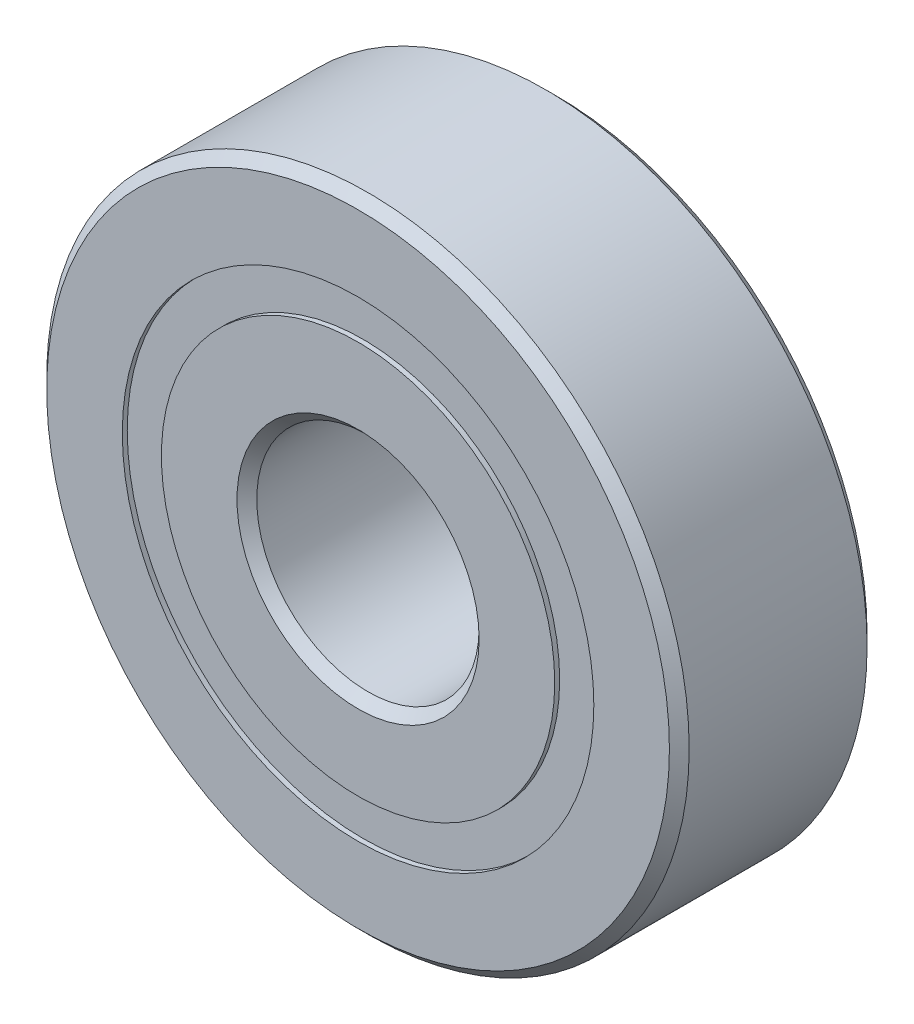
ISO-10303-21;
HEADER;
FILE_DESCRIPTION(('STEP AP214'),'2;1');
FILE_NAME('part.step','',(''),(''),'','','');
FILE_SCHEMA(('AUTOMOTIVE_DESIGN { 1 0 10303 214 1 1 1 1 }'));
ENDSEC;
DATA;
#1=APPLICATION_CONTEXT('core data for automotive mechanical design processes');
#2=APPLICATION_PROTOCOL_DEFINITION('international standard','automotive_design',2000,#1);
#3=PRODUCT_CONTEXT('',#1,'mechanical');
#4=PRODUCT('Part','Part','',(#3));
#5=PRODUCT_RELATED_PRODUCT_CATEGORY('part','',(#4));
#6=PRODUCT_DEFINITION_FORMATION('','',#4);
#7=PRODUCT_DEFINITION_CONTEXT('part definition',#1,'design');
#8=PRODUCT_DEFINITION('design','',#6,#7);
#9=PRODUCT_DEFINITION_SHAPE('','',#8);
#10=(LENGTH_UNIT() NAMED_UNIT(*) SI_UNIT(.MILLI.,.METRE.));
#11=(NAMED_UNIT(*) PLANE_ANGLE_UNIT() SI_UNIT($,.RADIAN.));
#12=(NAMED_UNIT(*) SI_UNIT($,.STERADIAN.) SOLID_ANGLE_UNIT());
#13=UNCERTAINTY_MEASURE_WITH_UNIT(LENGTH_MEASURE(1.E-05),#10,'distance_accuracy_value','');
#14=(GEOMETRIC_REPRESENTATION_CONTEXT(3) GLOBAL_UNCERTAINTY_ASSIGNED_CONTEXT((#13)) GLOBAL_UNIT_ASSIGNED_CONTEXT((#10,
#11,#12)) REPRESENTATION_CONTEXT('',''));
#15=CARTESIAN_POINT('',(0.,0.,0.));
#16=DIRECTION('',(0.,0.,1.));
#17=DIRECTION('',(1.,0.,0.));
#18=AXIS2_PLACEMENT_3D('',#15,#16,#17);
#19=CARTESIAN_POINT('',(0.,9.54120879120879,-3.8));
#20=DIRECTION('',(0.,0.,1.));
#21=DIRECTION('',(1.,0.,0.));
#22=AXIS2_PLACEMENT_3D('',#19,#20,#21);
#23=PLANE('',#22);
#24=CARTESIAN_POINT('',(0.,0.,-3.8));
#25=DIRECTION('',(0.,0.,1.));
#26=DIRECTION('',(1.,0.,0.));
#27=AXIS2_PLACEMENT_3D('',#24,#25,#26);
#28=CIRCLE('',#27,9.54120879120879);
#29=CARTESIAN_POINT('',(9.54120879120879,0.,-3.8));
#30=VERTEX_POINT('',#29);
#31=EDGE_CURVE('E54',#30,#30,#28,.T.);
#32=ORIENTED_EDGE('',*,*,#31,.F.);
#33=EDGE_LOOP('',(#32));
#34=FACE_BOUND('',#33,.T.);
#35=CARTESIAN_POINT('',(0.,0.,-3.8));
#36=DIRECTION('',(0.,0.,1.));
#37=DIRECTION('',(1.,0.,0.));
#38=AXIS2_PLACEMENT_3D('',#35,#36,#37);
#39=CIRCLE('',#38,7.95879120879121);
#40=CARTESIAN_POINT('',(7.95879120879121,0.,-3.8));
#41=VERTEX_POINT('',#40);
#42=EDGE_CURVE('E11',#41,#41,#39,.T.);
#43=ORIENTED_EDGE('',*,*,#42,.T.);
#44=EDGE_LOOP('',(#43));
#45=FACE_BOUND('',#44,.T.);
#46=ADVANCED_FACE('F40',(#34,#45),#23,.F.);
#47=CARTESIAN_POINT('',(0.,0.,4.));
#48=DIRECTION('',(0.,0.,1.));
#49=DIRECTION('',(1.,0.,0.));
#50=AXIS2_PLACEMENT_3D('',#47,#48,#49);
#51=CYLINDRICAL_SURFACE('',#50,7.95879120879121);
#52=ORIENTED_EDGE('',*,*,#42,.F.);
#53=EDGE_LOOP('',(#52));
#54=FACE_BOUND('',#53,.T.);
#55=CARTESIAN_POINT('',(0.,0.,-1.94589444175335));
#56=DIRECTION('',(0.,0.,1.));
#57=DIRECTION('',(1.,0.,0.));
#58=AXIS2_PLACEMENT_3D('',#55,#56,#57);
#59=CIRCLE('',#58,7.95879120879121);
#60=CARTESIAN_POINT('',(7.95879120879121,0.,-1.94589444175335));
#61=VERTEX_POINT('',#60);
#62=EDGE_CURVE('E46',#61,#61,#59,.T.);
#63=ORIENTED_EDGE('',*,*,#62,.T.);
#64=EDGE_LOOP('',(#63));
#65=FACE_BOUND('',#64,.T.);
#66=ADVANCED_FACE('F63',(#54,#65),#51,.F.);
#67=CARTESIAN_POINT('',(0.,9.54120879120879,-1.94589444175335));
#68=DIRECTION('',(0.,0.,-1.));
#69=DIRECTION('',(-1.,0.,0.));
#70=AXIS2_PLACEMENT_3D('',#67,#68,#69);
#71=PLANE('',#70);
#72=ORIENTED_EDGE('',*,*,#62,.F.);
#73=EDGE_LOOP('',(#72));
#74=FACE_BOUND('',#73,.T.);
#75=CARTESIAN_POINT('',(0.,0.,-1.94589444175335));
#76=DIRECTION('',(0.,0.,1.));
#77=DIRECTION('',(1.,0.,0.));
#78=AXIS2_PLACEMENT_3D('',#75,#76,#77);
#79=CIRCLE('',#78,9.54120879120879);
#80=CARTESIAN_POINT('',(9.54120879120879,0.,-1.94589444175335));
#81=VERTEX_POINT('',#80);
#82=EDGE_CURVE('E50',#81,#81,#79,.T.);
#83=ORIENTED_EDGE('',*,*,#82,.T.);
#84=EDGE_LOOP('',(#83));
#85=FACE_BOUND('',#84,.T.);
#86=ADVANCED_FACE('F67',(#74,#85),#71,.F.);
#87=CARTESIAN_POINT('',(0.,0.,4.));
#88=DIRECTION('',(0.,0.,1.));
#89=DIRECTION('',(1.,0.,0.));
#90=AXIS2_PLACEMENT_3D('',#87,#88,#89);
#91=CYLINDRICAL_SURFACE('',#90,9.54120879120879);
#92=ORIENTED_EDGE('',*,*,#82,.F.);
#93=EDGE_LOOP('',(#92));
#94=FACE_BOUND('',#93,.T.);
#95=ORIENTED_EDGE('',*,*,#31,.T.);
#96=EDGE_LOOP('',(#95));
#97=FACE_BOUND('',#96,.T.);
#98=ADVANCED_FACE('F60',(#94,#97),#91,.T.);
#99=CLOSED_SHELL('',(#46,#66,#86,#98));
#100=MANIFOLD_SOLID_BREP('B2',#99);
#101=CARTESIAN_POINT('',(0.,9.54120879120879,3.8));
#102=DIRECTION('',(0.,0.,-1.));
#103=DIRECTION('',(-1.,0.,0.));
#104=AXIS2_PLACEMENT_3D('',#101,#102,#103);
#105=PLANE('',#104);
#106=CARTESIAN_POINT('',(0.,0.,3.8));
#107=DIRECTION('',(0.,0.,1.));
#108=DIRECTION('',(1.,0.,0.));
#109=AXIS2_PLACEMENT_3D('',#106,#107,#108);
#110=CIRCLE('',#109,7.95879120879121);
#111=CARTESIAN_POINT('',(7.95879120879121,0.,3.8));
#112=VERTEX_POINT('',#111);
#113=EDGE_CURVE('E39',#112,#112,#110,.T.);
#114=ORIENTED_EDGE('',*,*,#113,.F.);
#115=EDGE_LOOP('',(#114));
#116=FACE_BOUND('',#115,.T.);
#117=CARTESIAN_POINT('',(0.,0.,3.8));
#118=DIRECTION('',(0.,0.,1.));
#119=DIRECTION('',(1.,0.,0.));
#120=AXIS2_PLACEMENT_3D('',#117,#118,#119);
#121=CIRCLE('',#120,9.54120879120879);
#122=CARTESIAN_POINT('',(9.54120879120879,0.,3.8));
#123=VERTEX_POINT('',#122);
#124=EDGE_CURVE('E122',#123,#123,#121,.T.);
#125=ORIENTED_EDGE('',*,*,#124,.T.);
#126=EDGE_LOOP('',(#125));
#127=FACE_BOUND('',#126,.T.);
#128=ADVANCED_FACE('F108',(#116,#127),#105,.F.);
#129=CARTESIAN_POINT('',(0.,0.,4.));
#130=DIRECTION('',(0.,0.,1.));
#131=DIRECTION('',(1.,0.,0.));
#132=AXIS2_PLACEMENT_3D('',#129,#130,#131);
#133=CYLINDRICAL_SURFACE('',#132,7.95879120879121);
#134=CARTESIAN_POINT('',(0.,0.,1.94589444175335));
#135=DIRECTION('',(0.,0.,1.));
#136=DIRECTION('',(1.,0.,0.));
#137=AXIS2_PLACEMENT_3D('',#134,#135,#136);
#138=CIRCLE('',#137,7.95879120879121);
#139=CARTESIAN_POINT('',(7.95879120879121,0.,1.94589444175335));
#140=VERTEX_POINT('',#139);
#141=EDGE_CURVE('E114',#140,#140,#138,.T.);
#142=ORIENTED_EDGE('',*,*,#141,.F.);
#143=EDGE_LOOP('',(#142));
#144=FACE_BOUND('',#143,.T.);
#145=ORIENTED_EDGE('',*,*,#113,.T.);
#146=EDGE_LOOP('',(#145));
#147=FACE_BOUND('',#146,.T.);
#148=ADVANCED_FACE('F137',(#144,#147),#133,.F.);
#149=CARTESIAN_POINT('',(0.,9.54120879120879,1.94589444175335));
#150=DIRECTION('',(0.,0.,1.));
#151=DIRECTION('',(1.,0.,0.));
#152=AXIS2_PLACEMENT_3D('',#149,#150,#151);
#153=PLANE('',#152);
#154=CARTESIAN_POINT('',(0.,0.,1.94589444175335));
#155=DIRECTION('',(0.,0.,1.));
#156=DIRECTION('',(1.,0.,0.));
#157=AXIS2_PLACEMENT_3D('',#154,#155,#156);
#158=CIRCLE('',#157,9.54120879120879);
#159=CARTESIAN_POINT('',(9.54120879120879,0.,1.94589444175335));
#160=VERTEX_POINT('',#159);
#161=EDGE_CURVE('E118',#160,#160,#158,.T.);
#162=ORIENTED_EDGE('',*,*,#161,.F.);
#163=EDGE_LOOP('',(#162));
#164=FACE_BOUND('',#163,.T.);
#165=ORIENTED_EDGE('',*,*,#141,.T.);
#166=EDGE_LOOP('',(#165));
#167=FACE_BOUND('',#166,.T.);
#168=ADVANCED_FACE('F132',(#164,#167),#153,.F.);
#169=CARTESIAN_POINT('',(0.,0.,4.));
#170=DIRECTION('',(0.,0.,1.));
#171=DIRECTION('',(1.,0.,0.));
#172=AXIS2_PLACEMENT_3D('',#169,#170,#171);
#173=CYLINDRICAL_SURFACE('',#172,9.54120879120879);
#174=ORIENTED_EDGE('',*,*,#124,.F.);
#175=EDGE_LOOP('',(#174));
#176=FACE_BOUND('',#175,.T.);
#177=ORIENTED_EDGE('',*,*,#161,.T.);
#178=EDGE_LOOP('',(#177));
#179=FACE_BOUND('',#178,.T.);
#180=ADVANCED_FACE('F129',(#176,#179),#173,.T.);
#181=CLOSED_SHELL('',(#128,#148,#168,#180));
#182=MANIFOLD_SOLID_BREP('B6',#181);
#183=CARTESIAN_POINT('',(-4.3749999999999,7.57772228311389,0.));
#184=DIRECTION('',(0.,0.,1.));
#185=DIRECTION('',(-0.499999999999989,0.866025403784445,0.));
#186=AXIS2_PLACEMENT_3D('',#183,#184,#185);
#187=SPHERICAL_SURFACE('',#186,1.94589444175335);
#188=CARTESIAN_POINT('',(-4.3749999999999,7.57772228311389,1.94589444175335));
#189=VERTEX_POINT('',#188);
#190=VERTEX_LOOP('',#189);
#191=FACE_BOUND('',#190,.T.);
#192=ADVANCED_FACE('F176',(#191),#187,.T.);
#193=CLOSED_SHELL('',(#192));
#194=MANIFOLD_SOLID_BREP('B34',#193);
#195=CARTESIAN_POINT('',(-7.57772228311379,4.37500000000009,0.));
#196=DIRECTION('',(0.,0.,1.));
#197=DIRECTION('',(-0.866025403784433,0.50000000000001,0.));
#198=AXIS2_PLACEMENT_3D('',#195,#196,#197);
#199=SPHERICAL_SURFACE('',#198,1.94589444175335);
#200=CARTESIAN_POINT('',(-7.57772228311379,4.37500000000009,1.94589444175335));
#201=VERTEX_POINT('',#200);
#202=VERTEX_LOOP('',#201);
#203=FACE_BOUND('',#202,.T.);
#204=ADVANCED_FACE('F197',(#203),#199,.T.);
#205=CLOSED_SHELL('',(#204));
#206=MANIFOLD_SOLID_BREP('B104',#205);
#207=CARTESIAN_POINT('',(-8.75,0.,0.));
#208=DIRECTION('',(0.,0.,1.));
#209=DIRECTION('',(-1.,0.,0.));
#210=AXIS2_PLACEMENT_3D('',#207,#208,#209);
#211=SPHERICAL_SURFACE('',#210,1.94589444175335);
#212=CARTESIAN_POINT('',(-8.75,0.,1.94589444175335));
#213=VERTEX_POINT('',#212);
#214=VERTEX_LOOP('',#213);
#215=FACE_BOUND('',#214,.T.);
#216=ADVANCED_FACE('F218',(#215),#211,.T.);
#217=CLOSED_SHELL('',(#216));
#218=MANIFOLD_SOLID_BREP('B172',#217);
#219=CARTESIAN_POINT('',(-7.57772228311388,-4.37499999999993,0.));
#220=DIRECTION('',(0.,0.,1.));
#221=DIRECTION('',(-0.866025403784443,-0.499999999999992,0.));
#222=AXIS2_PLACEMENT_3D('',#219,#220,#221);
#223=SPHERICAL_SURFACE('',#222,1.94589444175335);
#224=CARTESIAN_POINT('',(-7.57772228311388,-4.37499999999993,1.94589444175335));
#225=VERTEX_POINT('',#224);
#226=VERTEX_LOOP('',#225);
#227=FACE_BOUND('',#226,.T.);
#228=ADVANCED_FACE('F239',(#227),#223,.T.);
#229=CLOSED_SHELL('',(#228));
#230=MANIFOLD_SOLID_BREP('B193',#229);
#231=CARTESIAN_POINT('',(-4.37500000000006,-7.5777222831138,0.));
#232=DIRECTION('',(0.,0.,1.));
#233=DIRECTION('',(-0.500000000000007,-0.866025403784435,0.));
#234=AXIS2_PLACEMENT_3D('',#231,#232,#233);
#235=SPHERICAL_SURFACE('',#234,1.94589444175335);
#236=CARTESIAN_POINT('',(-4.37500000000006,-7.5777222831138,1.94589444175335));
#237=VERTEX_POINT('',#236);
#238=VERTEX_LOOP('',#237);
#239=FACE_BOUND('',#238,.T.);
#240=ADVANCED_FACE('F260',(#239),#235,.T.);
#241=CLOSED_SHELL('',(#240));
#242=MANIFOLD_SOLID_BREP('B214',#241);
#243=CARTESIAN_POINT('',(0.,-8.75,0.));
#244=DIRECTION('',(0.,0.,1.));
#245=DIRECTION('',(0.,-1.,0.));
#246=AXIS2_PLACEMENT_3D('',#243,#244,#245);
#247=SPHERICAL_SURFACE('',#246,1.94589444175335);
#248=CARTESIAN_POINT('',(0.,-8.75,1.94589444175335));
#249=VERTEX_POINT('',#248);
#250=VERTEX_LOOP('',#249);
#251=FACE_BOUND('',#250,.T.);
#252=ADVANCED_FACE('F281',(#251),#247,.T.);
#253=CLOSED_SHELL('',(#252));
#254=MANIFOLD_SOLID_BREP('B235',#253);
#255=CARTESIAN_POINT('',(4.37499999999996,-7.57772228311386,0.));
#256=DIRECTION('',(0.,0.,1.));
#257=DIRECTION('',(0.499999999999995,-0.866025403784442,0.));
#258=AXIS2_PLACEMENT_3D('',#255,#256,#257);
#259=SPHERICAL_SURFACE('',#258,1.94589444175335);
#260=CARTESIAN_POINT('',(4.37499999999996,-7.57772228311386,1.94589444175335));
#261=VERTEX_POINT('',#260);
#262=VERTEX_LOOP('',#261);
#263=FACE_BOUND('',#262,.T.);
#264=ADVANCED_FACE('F302',(#263),#259,.T.);
#265=CLOSED_SHELL('',(#264));
#266=MANIFOLD_SOLID_BREP('B256',#265);
#267=CARTESIAN_POINT('',(7.57772228311382,-4.37500000000004,0.));
#268=DIRECTION('',(0.,0.,1.));
#269=DIRECTION('',(0.866025403784436,-0.500000000000004,0.));
#270=AXIS2_PLACEMENT_3D('',#267,#268,#269);
#271=SPHERICAL_SURFACE('',#270,1.94589444175335);
#272=CARTESIAN_POINT('',(7.57772228311382,-4.37500000000004,1.94589444175335));
#273=VERTEX_POINT('',#272);
#274=VERTEX_LOOP('',#273);
#275=FACE_BOUND('',#274,.T.);
#276=ADVANCED_FACE('F323',(#275),#271,.T.);
#277=CLOSED_SHELL('',(#276));
#278=MANIFOLD_SOLID_BREP('B277',#277);
#279=CARTESIAN_POINT('',(8.75,0.,0.));
#280=DIRECTION('',(0.,0.,1.));
#281=DIRECTION('',(1.,0.,0.));
#282=AXIS2_PLACEMENT_3D('',#279,#280,#281);
#283=SPHERICAL_SURFACE('',#282,1.94589444175335);
#284=CARTESIAN_POINT('',(8.75,0.,1.94589444175335));
#285=VERTEX_POINT('',#284);
#286=VERTEX_LOOP('',#285);
#287=FACE_BOUND('',#286,.T.);
#288=ADVANCED_FACE('F344',(#287),#283,.T.);
#289=CLOSED_SHELL('',(#288));
#290=MANIFOLD_SOLID_BREP('B298',#289);
#291=CARTESIAN_POINT('',(7.57772228311385,4.37499999999998,0.));
#292=DIRECTION('',(0.,0.,1.));
#293=DIRECTION('',(0.86602540378444,0.499999999999998,0.));
#294=AXIS2_PLACEMENT_3D('',#291,#292,#293);
#295=SPHERICAL_SURFACE('',#294,1.94589444175335);
#296=CARTESIAN_POINT('',(7.57772228311385,4.37499999999998,1.94589444175335));
#297=VERTEX_POINT('',#296);
#298=VERTEX_LOOP('',#297);
#299=FACE_BOUND('',#298,.T.);
#300=ADVANCED_FACE('F365',(#299),#295,.T.);
#301=CLOSED_SHELL('',(#300));
#302=MANIFOLD_SOLID_BREP('B319',#301);
#303=CARTESIAN_POINT('',(4.37500000000001,7.57772228311383,0.));
#304=DIRECTION('',(0.,0.,1.));
#305=DIRECTION('',(0.500000000000001,0.866025403784438,0.));
#306=AXIS2_PLACEMENT_3D('',#303,#304,#305);
#307=SPHERICAL_SURFACE('',#306,1.94589444175335);
#308=CARTESIAN_POINT('',(4.37500000000001,7.57772228311383,1.94589444175335));
#309=VERTEX_POINT('',#308);
#310=VERTEX_LOOP('',#309);
#311=FACE_BOUND('',#310,.T.);
#312=ADVANCED_FACE('F386',(#311),#307,.T.);
#313=CLOSED_SHELL('',(#312));
#314=MANIFOLD_SOLID_BREP('B340',#313);
#315=CARTESIAN_POINT('',(0.,8.75,0.));
#316=DIRECTION('',(0.,0.,1.));
#317=DIRECTION('',(0.,1.,0.));
#318=AXIS2_PLACEMENT_3D('',#315,#316,#317);
#319=SPHERICAL_SURFACE('',#318,1.94589444175335);
#320=CARTESIAN_POINT('',(0.,8.75,1.94589444175335));
#321=VERTEX_POINT('',#320);
#322=VERTEX_LOOP('',#321);
#323=FACE_BOUND('',#322,.T.);
#324=ADVANCED_FACE('F409',(#323),#319,.T.);
#325=CLOSED_SHELL('',(#324));
#326=MANIFOLD_SOLID_BREP('B361',#325);
#327=CARTESIAN_POINT('',(0.,7.95879120879121,4.));
#328=DIRECTION('',(0.,0.,-1.));
#329=DIRECTION('',(-1.,0.,0.));
#330=AXIS2_PLACEMENT_3D('',#327,#328,#329);
#331=PLANE('',#330);
#332=CARTESIAN_POINT('',(0.,0.,4.));
#333=DIRECTION('',(0.,0.,1.));
#334=DIRECTION('',(1.,0.,0.));
#335=AXIS2_PLACEMENT_3D('',#332,#333,#334);
#336=CIRCLE('',#335,4.9);
#337=CARTESIAN_POINT('',(4.9,0.,4.));
#338=VERTEX_POINT('',#337);
#339=EDGE_CURVE('E457',#338,#338,#336,.T.);
#340=ORIENTED_EDGE('',*,*,#339,.F.);
#341=EDGE_LOOP('',(#340));
#342=FACE_BOUND('',#341,.T.);
#343=CARTESIAN_POINT('',(0.,0.,4.));
#344=DIRECTION('',(0.,0.,1.));
#345=DIRECTION('',(1.,0.,0.));
#346=AXIS2_PLACEMENT_3D('',#343,#344,#345);
#347=CIRCLE('',#346,7.95879120879121);
#348=CARTESIAN_POINT('',(7.95879120879121,0.,4.));
#349=VERTEX_POINT('',#348);
#350=EDGE_CURVE('E408',#349,#349,#347,.T.);
#351=ORIENTED_EDGE('',*,*,#350,.T.);
#352=EDGE_LOOP('',(#351));
#353=FACE_BOUND('',#352,.T.);
#354=ADVANCED_FACE('F429',(#342,#353),#331,.F.);
#355=CARTESIAN_POINT('',(0.,0.,4.));
#356=DIRECTION('',(0.,0.,1.));
#357=DIRECTION('',(1.,0.,0.));
#358=AXIS2_PLACEMENT_3D('',#355,#356,#357);
#359=CYLINDRICAL_SURFACE('',#358,7.95879120879121);
#360=ORIENTED_EDGE('',*,*,#350,.F.);
#361=EDGE_LOOP('',(#360));
#362=FACE_BOUND('',#361,.T.);
#363=CARTESIAN_POINT('',(0.,0.,1.77777777777778));
#364=DIRECTION('',(0.,0.,1.));
#365=DIRECTION('',(1.,0.,0.));
#366=AXIS2_PLACEMENT_3D('',#363,#364,#365);
#367=CIRCLE('',#366,7.95879120879121);
#368=CARTESIAN_POINT('',(7.95879120879121,0.,1.77777777777778));
#369=VERTEX_POINT('',#368);
#370=EDGE_CURVE('E435',#369,#369,#367,.T.);
#371=ORIENTED_EDGE('',*,*,#370,.T.);
#372=EDGE_LOOP('',(#371));
#373=FACE_BOUND('',#372,.T.);
#374=ADVANCED_FACE('F464',(#362,#373),#359,.T.);
#375=CARTESIAN_POINT('',(0.,0.,0.));
#376=DIRECTION('',(0.,0.,1.));
#377=DIRECTION('',(1.,0.,0.));
#378=AXIS2_PLACEMENT_3D('',#375,#376,#377);
#379=TOROIDAL_SURFACE('',#378,8.75,1.94589444175334);
#380=ORIENTED_EDGE('',*,*,#370,.F.);
#381=EDGE_LOOP('',(#380));
#382=FACE_BOUND('',#381,.T.);
#383=CARTESIAN_POINT('',(0.,0.,-1.77777777777778));
#384=DIRECTION('',(0.,0.,1.));
#385=DIRECTION('',(1.,0.,0.));
#386=AXIS2_PLACEMENT_3D('',#383,#384,#385);
#387=CIRCLE('',#386,7.95879120879121);
#388=CARTESIAN_POINT('',(7.95879120879121,0.,-1.77777777777778));
#389=VERTEX_POINT('',#388);
#390=EDGE_CURVE('E439',#389,#389,#387,.T.);
#391=ORIENTED_EDGE('',*,*,#390,.T.);
#392=EDGE_LOOP('',(#391));
#393=FACE_BOUND('',#392,.T.);
#394=ADVANCED_FACE('F468',(#382,#393),#379,.F.);
#395=CARTESIAN_POINT('',(0.,0.,4.));
#396=DIRECTION('',(0.,0.,1.));
#397=DIRECTION('',(1.,0.,0.));
#398=AXIS2_PLACEMENT_3D('',#395,#396,#397);
#399=CYLINDRICAL_SURFACE('',#398,7.95879120879121);
#400=ORIENTED_EDGE('',*,*,#390,.F.);
#401=EDGE_LOOP('',(#400));
#402=FACE_BOUND('',#401,.T.);
#403=CARTESIAN_POINT('',(0.,0.,-4.));
#404=DIRECTION('',(0.,0.,1.));
#405=DIRECTION('',(1.,0.,0.));
#406=AXIS2_PLACEMENT_3D('',#403,#404,#405);
#407=CIRCLE('',#406,7.95879120879121);
#408=CARTESIAN_POINT('',(7.95879120879121,0.,-4.));
#409=VERTEX_POINT('',#408);
#410=EDGE_CURVE('E443',#409,#409,#407,.T.);
#411=ORIENTED_EDGE('',*,*,#410,.T.);
#412=EDGE_LOOP('',(#411));
#413=FACE_BOUND('',#412,.T.);
#414=ADVANCED_FACE('F473',(#402,#413),#399,.T.);
#415=CARTESIAN_POINT('',(0.,4.9,-4.));
#416=DIRECTION('',(0.,0.,1.));
#417=DIRECTION('',(1.,0.,0.));
#418=AXIS2_PLACEMENT_3D('',#415,#416,#417);
#419=PLANE('',#418);
#420=ORIENTED_EDGE('',*,*,#410,.F.);
#421=EDGE_LOOP('',(#420));
#422=FACE_BOUND('',#421,.T.);
#423=CARTESIAN_POINT('',(0.,0.,-4.));
#424=DIRECTION('',(0.,0.,1.));
#425=DIRECTION('',(1.,0.,0.));
#426=AXIS2_PLACEMENT_3D('',#423,#424,#425);
#427=CIRCLE('',#426,4.9);
#428=CARTESIAN_POINT('',(4.9,0.,-4.));
#429=VERTEX_POINT('',#428);
#430=EDGE_CURVE('E448',#429,#429,#427,.T.);
#431=ORIENTED_EDGE('',*,*,#430,.T.);
#432=EDGE_LOOP('',(#431));
#433=FACE_BOUND('',#432,.T.);
#434=ADVANCED_FACE('F479',(#422,#433),#419,.F.);
#435=CARTESIAN_POINT('',(0.,0.,-3.6));
#436=DIRECTION('',(0.,0.,-1.));
#437=DIRECTION('',(-1.,0.,0.));
#438=AXIS2_PLACEMENT_3D('',#435,#436,#437);
#439=CONICAL_SURFACE('',#438,4.5,0.785398163397444);
#440=ORIENTED_EDGE('',*,*,#430,.F.);
#441=EDGE_LOOP('',(#440));
#442=FACE_BOUND('',#441,.T.);
#443=CARTESIAN_POINT('',(0.,0.,-3.6));
#444=DIRECTION('',(0.,0.,1.));
#445=DIRECTION('',(1.,0.,0.));
#446=AXIS2_PLACEMENT_3D('',#443,#444,#445);
#447=CIRCLE('',#446,4.5);
#448=CARTESIAN_POINT('',(4.5,0.,-3.6));
#449=VERTEX_POINT('',#448);
#450=EDGE_CURVE('E451',#449,#449,#447,.T.);
#451=ORIENTED_EDGE('',*,*,#450,.T.);
#452=EDGE_LOOP('',(#451));
#453=FACE_BOUND('',#452,.T.);
#454=ADVANCED_FACE('F483',(#442,#453),#439,.F.);
#455=CARTESIAN_POINT('',(0.,0.,4.));
#456=DIRECTION('',(0.,0.,1.));
#457=DIRECTION('',(1.,0.,0.));
#458=AXIS2_PLACEMENT_3D('',#455,#456,#457);
#459=CYLINDRICAL_SURFACE('',#458,4.5);
#460=ORIENTED_EDGE('',*,*,#450,.F.);
#461=EDGE_LOOP('',(#460));
#462=FACE_BOUND('',#461,.T.);
#463=CARTESIAN_POINT('',(0.,0.,3.6));
#464=DIRECTION('',(0.,0.,1.));
#465=DIRECTION('',(1.,0.,0.));
#466=AXIS2_PLACEMENT_3D('',#463,#464,#465);
#467=CIRCLE('',#466,4.5);
#468=CARTESIAN_POINT('',(4.5,0.,3.6));
#469=VERTEX_POINT('',#468);
#470=EDGE_CURVE('E454',#469,#469,#467,.T.);
#471=ORIENTED_EDGE('',*,*,#470,.T.);
#472=EDGE_LOOP('',(#471));
#473=FACE_BOUND('',#472,.T.);
#474=ADVANCED_FACE('F487',(#462,#473),#459,.F.);
#475=CARTESIAN_POINT('',(0.,0.,4.));
#476=DIRECTION('',(0.,0.,1.));
#477=DIRECTION('',(1.,0.,0.));
#478=AXIS2_PLACEMENT_3D('',#475,#476,#477);
#479=CONICAL_SURFACE('',#478,4.9,0.785398163397453);
#480=ORIENTED_EDGE('',*,*,#470,.F.);
#481=EDGE_LOOP('',(#480));
#482=FACE_BOUND('',#481,.T.);
#483=ORIENTED_EDGE('',*,*,#339,.T.);
#484=EDGE_LOOP('',(#483));
#485=FACE_BOUND('',#484,.T.);
#486=ADVANCED_FACE('F461',(#482,#485),#479,.F.);
#487=CLOSED_SHELL('',(#354,#374,#394,#414,#434,#454,#474,#486));
#488=MANIFOLD_SOLID_BREP('B382',#487);
#489=CARTESIAN_POINT('',(0.,0.,3.6));
#490=DIRECTION('',(0.,0.,-1.));
#491=DIRECTION('',(-1.,0.,0.));
#492=AXIS2_PLACEMENT_3D('',#489,#490,#491);
#493=CONICAL_SURFACE('',#492,13.,0.785398163397447);
#494=CARTESIAN_POINT('',(0.,0.,4.));
#495=DIRECTION('',(0.,0.,1.));
#496=DIRECTION('',(1.,0.,0.));
#497=AXIS2_PLACEMENT_3D('',#494,#495,#496);
#498=CIRCLE('',#497,12.6);
#499=CARTESIAN_POINT('',(12.6,0.,4.));
#500=VERTEX_POINT('',#499);
#501=EDGE_CURVE('E579',#500,#500,#498,.T.);
#502=ORIENTED_EDGE('',*,*,#501,.F.);
#503=EDGE_LOOP('',(#502));
#504=FACE_BOUND('',#503,.T.);
#505=CARTESIAN_POINT('',(0.,0.,3.6));
#506=DIRECTION('',(0.,0.,1.));
#507=DIRECTION('',(1.,0.,0.));
#508=AXIS2_PLACEMENT_3D('',#505,#506,#507);
#509=CIRCLE('',#508,13.);
#510=CARTESIAN_POINT('',(13.,0.,3.6));
#511=VERTEX_POINT('',#510);
#512=EDGE_CURVE('E428',#511,#511,#509,.T.);
#513=ORIENTED_EDGE('',*,*,#512,.T.);
#514=EDGE_LOOP('',(#513));
#515=FACE_BOUND('',#514,.T.);
#516=ADVANCED_FACE('F551',(#504,#515),#493,.T.);
#517=CARTESIAN_POINT('',(0.,0.,4.));
#518=DIRECTION('',(0.,0.,1.));
#519=DIRECTION('',(1.,0.,0.));
#520=AXIS2_PLACEMENT_3D('',#517,#518,#519);
#521=CYLINDRICAL_SURFACE('',#520,13.);
#522=ORIENTED_EDGE('',*,*,#512,.F.);
#523=EDGE_LOOP('',(#522));
#524=FACE_BOUND('',#523,.T.);
#525=CARTESIAN_POINT('',(0.,0.,-3.6));
#526=DIRECTION('',(0.,0.,1.));
#527=DIRECTION('',(1.,0.,0.));
#528=AXIS2_PLACEMENT_3D('',#525,#526,#527);
#529=CIRCLE('',#528,13.);
#530=CARTESIAN_POINT('',(13.,0.,-3.6));
#531=VERTEX_POINT('',#530);
#532=EDGE_CURVE('E557',#531,#531,#529,.T.);
#533=ORIENTED_EDGE('',*,*,#532,.T.);
#534=EDGE_LOOP('',(#533));
#535=FACE_BOUND('',#534,.T.);
#536=ADVANCED_FACE('F586',(#524,#535),#521,.T.);
#537=CARTESIAN_POINT('',(0.,0.,-4.));
#538=DIRECTION('',(0.,0.,1.));
#539=DIRECTION('',(1.,0.,0.));
#540=AXIS2_PLACEMENT_3D('',#537,#538,#539);
#541=CONICAL_SURFACE('',#540,12.6,0.785398163397447);
#542=ORIENTED_EDGE('',*,*,#532,.F.);
#543=EDGE_LOOP('',(#542));
#544=FACE_BOUND('',#543,.T.);
#545=CARTESIAN_POINT('',(0.,0.,-4.));
#546=DIRECTION('',(0.,0.,1.));
#547=DIRECTION('',(1.,0.,0.));
#548=AXIS2_PLACEMENT_3D('',#545,#546,#547);
#549=CIRCLE('',#548,12.6);
#550=CARTESIAN_POINT('',(12.6,0.,-4.));
#551=VERTEX_POINT('',#550);
#552=EDGE_CURVE('E561',#551,#551,#549,.T.);
#553=ORIENTED_EDGE('',*,*,#552,.T.);
#554=EDGE_LOOP('',(#553));
#555=FACE_BOUND('',#554,.T.);
#556=ADVANCED_FACE('F590',(#544,#555),#541,.T.);
#557=CARTESIAN_POINT('',(0.,12.6,-4.));
#558=DIRECTION('',(0.,0.,1.));
#559=DIRECTION('',(1.,0.,0.));
#560=AXIS2_PLACEMENT_3D('',#557,#558,#559);
#561=PLANE('',#560);
#562=ORIENTED_EDGE('',*,*,#552,.F.);
#563=EDGE_LOOP('',(#562));
#564=FACE_BOUND('',#563,.T.);
#565=CARTESIAN_POINT('',(0.,0.,-4.));
#566=DIRECTION('',(0.,0.,1.));
#567=DIRECTION('',(1.,0.,0.));
#568=AXIS2_PLACEMENT_3D('',#565,#566,#567);
#569=CIRCLE('',#568,9.54120879120879);
#570=CARTESIAN_POINT('',(9.54120879120879,0.,-4.));
#571=VERTEX_POINT('',#570);
#572=EDGE_CURVE('E565',#571,#571,#569,.T.);
#573=ORIENTED_EDGE('',*,*,#572,.T.);
#574=EDGE_LOOP('',(#573));
#575=FACE_BOUND('',#574,.T.);
#576=ADVANCED_FACE('F595',(#564,#575),#561,.F.);
#577=CARTESIAN_POINT('',(0.,0.,4.));
#578=DIRECTION('',(0.,0.,1.));
#579=DIRECTION('',(1.,0.,0.));
#580=AXIS2_PLACEMENT_3D('',#577,#578,#579);
#581=CYLINDRICAL_SURFACE('',#580,9.54120879120879);
#582=ORIENTED_EDGE('',*,*,#572,.F.);
#583=EDGE_LOOP('',(#582));
#584=FACE_BOUND('',#583,.T.);
#585=CARTESIAN_POINT('',(0.,0.,-1.77777777777778));
#586=DIRECTION('',(0.,0.,1.));
#587=DIRECTION('',(1.,0.,0.));
#588=AXIS2_PLACEMENT_3D('',#585,#586,#587);
#589=CIRCLE('',#588,9.54120879120879);
#590=CARTESIAN_POINT('',(9.54120879120879,0.,-1.77777777777778));
#591=VERTEX_POINT('',#590);
#592=EDGE_CURVE('E570',#591,#591,#589,.T.);
#593=ORIENTED_EDGE('',*,*,#592,.T.);
#594=EDGE_LOOP('',(#593));
#595=FACE_BOUND('',#594,.T.);
#596=ADVANCED_FACE('F601',(#584,#595),#581,.F.);
#597=CARTESIAN_POINT('',(0.,0.,0.));
#598=DIRECTION('',(0.,0.,1.));
#599=DIRECTION('',(1.,0.,0.));
#600=AXIS2_PLACEMENT_3D('',#597,#598,#599);
#601=TOROIDAL_SURFACE('',#600,8.75,1.94589444175335);
#602=ORIENTED_EDGE('',*,*,#592,.F.);
#603=EDGE_LOOP('',(#602));
#604=FACE_BOUND('',#603,.T.);
#605=CARTESIAN_POINT('',(0.,0.,1.77777777777778));
#606=DIRECTION('',(0.,0.,1.));
#607=DIRECTION('',(1.,0.,0.));
#608=AXIS2_PLACEMENT_3D('',#605,#606,#607);
#609=CIRCLE('',#608,9.54120879120879);
#610=CARTESIAN_POINT('',(9.54120879120879,0.,1.77777777777778));
#611=VERTEX_POINT('',#610);
#612=EDGE_CURVE('E573',#611,#611,#609,.T.);
#613=ORIENTED_EDGE('',*,*,#612,.T.);
#614=EDGE_LOOP('',(#613));
#615=FACE_BOUND('',#614,.T.);
#616=ADVANCED_FACE('F605',(#604,#615),#601,.F.);
#617=CARTESIAN_POINT('',(0.,0.,4.));
#618=DIRECTION('',(0.,0.,1.));
#619=DIRECTION('',(1.,0.,0.));
#620=AXIS2_PLACEMENT_3D('',#617,#618,#619);
#621=CYLINDRICAL_SURFACE('',#620,9.54120879120879);
#622=ORIENTED_EDGE('',*,*,#612,.F.);
#623=EDGE_LOOP('',(#622));
#624=FACE_BOUND('',#623,.T.);
#625=CARTESIAN_POINT('',(0.,0.,4.));
#626=DIRECTION('',(0.,0.,1.));
#627=DIRECTION('',(1.,0.,0.));
#628=AXIS2_PLACEMENT_3D('',#625,#626,#627);
#629=CIRCLE('',#628,9.54120879120879);
#630=CARTESIAN_POINT('',(9.54120879120879,0.,4.));
#631=VERTEX_POINT('',#630);
#632=EDGE_CURVE('E576',#631,#631,#629,.T.);
#633=ORIENTED_EDGE('',*,*,#632,.T.);
#634=EDGE_LOOP('',(#633));
#635=FACE_BOUND('',#634,.T.);
#636=ADVANCED_FACE('F609',(#624,#635),#621,.F.);
#637=CARTESIAN_POINT('',(0.,12.6,4.));
#638=DIRECTION('',(0.,0.,-1.));
#639=DIRECTION('',(-1.,0.,0.));
#640=AXIS2_PLACEMENT_3D('',#637,#638,#639);
#641=PLANE('',#640);
#642=ORIENTED_EDGE('',*,*,#632,.F.);
#643=EDGE_LOOP('',(#642));
#644=FACE_BOUND('',#643,.T.);
#645=ORIENTED_EDGE('',*,*,#501,.T.);
#646=EDGE_LOOP('',(#645));
#647=FACE_BOUND('',#646,.T.);
#648=ADVANCED_FACE('F583',(#644,#647),#641,.F.);
#649=CLOSED_SHELL('',(#516,#536,#556,#576,#596,#616,#636,#648));
#650=MANIFOLD_SOLID_BREP('B403',#649);
#651=ADVANCED_BREP_SHAPE_REPRESENTATION('',(#18,#100,#182,#194,#206,#218,#230,#242,#254,#266,
#278,#290,#302,#314,#326,#488,#650),#14);
#652=SHAPE_DEFINITION_REPRESENTATION(#9,#651);
ENDSEC;
END-ISO-10303-21;
